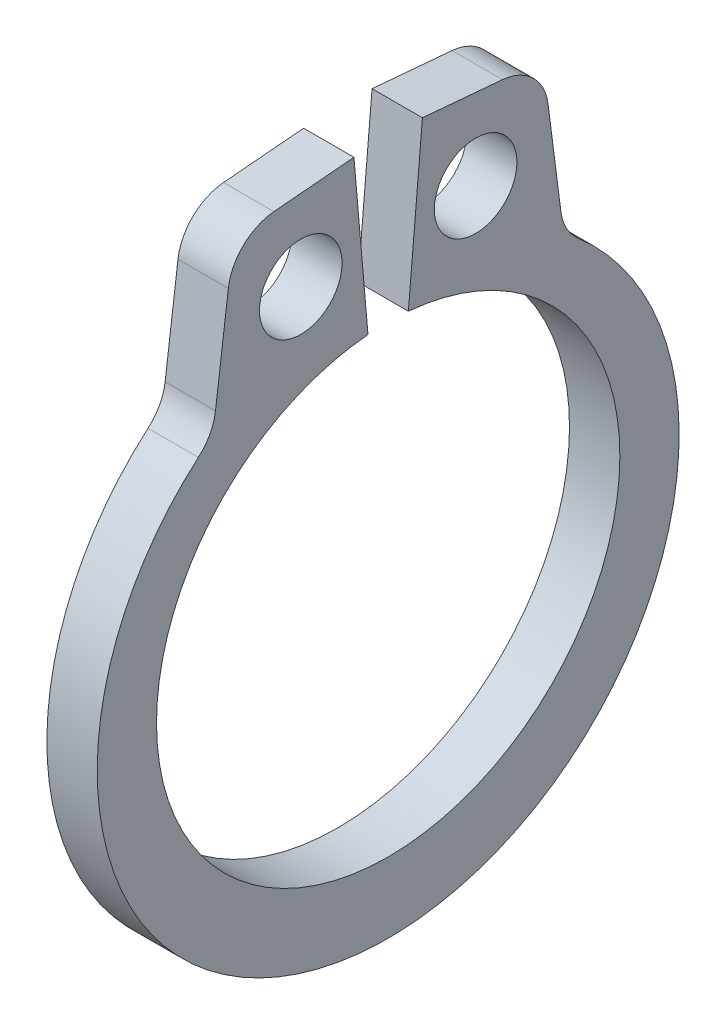
ISO-10303-21;
HEADER;
FILE_DESCRIPTION(('STEP AP214'),'2;1');
FILE_NAME('part.step','',(''),(''),'','','');
FILE_SCHEMA(('AUTOMOTIVE_DESIGN { 1 0 10303 214 1 1 1 1 }'));
ENDSEC;
DATA;
#1=APPLICATION_CONTEXT('core data for automotive mechanical design processes');
#2=APPLICATION_PROTOCOL_DEFINITION('international standard','automotive_design',2000,#1);
#3=PRODUCT_CONTEXT('',#1,'mechanical');
#4=PRODUCT('Part','Part','',(#3));
#5=PRODUCT_RELATED_PRODUCT_CATEGORY('part','',(#4));
#6=PRODUCT_DEFINITION_FORMATION('','',#4);
#7=PRODUCT_DEFINITION_CONTEXT('part definition',#1,'design');
#8=PRODUCT_DEFINITION('design','',#6,#7);
#9=PRODUCT_DEFINITION_SHAPE('','',#8);
#10=(LENGTH_UNIT() NAMED_UNIT(*) SI_UNIT(.MILLI.,.METRE.));
#11=(NAMED_UNIT(*) PLANE_ANGLE_UNIT() SI_UNIT($,.RADIAN.));
#12=(NAMED_UNIT(*) SI_UNIT($,.STERADIAN.) SOLID_ANGLE_UNIT());
#13=UNCERTAINTY_MEASURE_WITH_UNIT(LENGTH_MEASURE(1.E-05),#10,'distance_accuracy_value','');
#14=(GEOMETRIC_REPRESENTATION_CONTEXT(3) GLOBAL_UNCERTAINTY_ASSIGNED_CONTEXT((#13)) GLOBAL_UNIT_ASSIGNED_CONTEXT((#10,
#11,#12)) REPRESENTATION_CONTEXT('',''));
#15=CARTESIAN_POINT('',(0.,0.,0.));
#16=DIRECTION('',(0.,0.,1.));
#17=DIRECTION('',(1.,0.,0.));
#18=AXIS2_PLACEMENT_3D('',#15,#16,#17);
#19=CARTESIAN_POINT('',(0.3175,0.,0.));
#20=DIRECTION('',(1.,0.,0.));
#21=DIRECTION('',(0.,0.,-1.));
#22=AXIS2_PLACEMENT_3D('',#19,#20,#21);
#23=PLANE('',#22);
#24=CARTESIAN_POINT('',(0.3175,3.85560585041349,-1.10223251914344));
#25=DIRECTION('',(-1.,0.,0.));
#26=DIRECTION('',(0.,0.,1.));
#27=AXIS2_PLACEMENT_3D('',#24,#25,#26);
#28=CIRCLE('',#27,0.5207);
#29=CARTESIAN_POINT('',(0.3175,3.85560585041349,-0.581532519143441));
#30=VERTEX_POINT('',#29);
#31=EDGE_CURVE('E107',#30,#30,#28,.T.);
#32=ORIENTED_EDGE('',*,*,#31,.T.);
#33=EDGE_LOOP('',(#32));
#34=FACE_BOUND('',#33,.T.);
#35=CARTESIAN_POINT('',(0.3175,0.,0.));
#36=DIRECTION('',(-1.,0.,0.));
#37=DIRECTION('',(0.,0.,1.));
#38=AXIS2_PLACEMENT_3D('',#35,#36,#37);
#39=CIRCLE('',#38,2.921);
#40=CARTESIAN_POINT('',(0.3175,2.90988471312599,-0.25458192456591));
#41=VERTEX_POINT('',#40);
#42=CARTESIAN_POINT('',(0.3175,2.90988471312599,0.25458192456591));
#43=VERTEX_POINT('',#42);
#44=EDGE_CURVE('E173',#41,#43,#39,.T.);
#45=ORIENTED_EDGE('',*,*,#44,.T.);
#46=DIRECTION('',(0.,-0.996194698091746,-0.0871557427476584));
#47=VECTOR('',#46,1.);
#48=CARTESIAN_POINT('',(0.3175,2.90988471312599,0.25458192456591));
#49=LINE('',#48,#47);
#50=CARTESIAN_POINT('',(0.3175,4.93415233964842,0.431682393829152));
#51=VERTEX_POINT('',#50);
#52=EDGE_CURVE('E123',#43,#51,#49,.F.);
#53=ORIENTED_EDGE('',*,*,#52,.T.);
#54=DIRECTION('',(0.,0.0871557427476587,-0.996194698091746));
#55=VECTOR('',#54,1.);
#56=CARTESIAN_POINT('',(0.3175,4.93415233964842,0.431682393829152));
#57=LINE('',#56,#55);
#58=CARTESIAN_POINT('',(0.3175,4.84586515186069,1.44080956790658));
#59=VERTEX_POINT('',#58);
#60=EDGE_CURVE('E118',#51,#59,#57,.F.);
#61=ORIENTED_EDGE('',*,*,#60,.T.);
#62=CARTESIAN_POINT('',(0.3175,4.21328151857243,1.38546567126182));
#63=DIRECTION('',(-1.,0.,0.));
#64=DIRECTION('',(0.,0.,1.));
#65=AXIS2_PLACEMENT_3D('',#62,#63,#64);
#66=CIRCLE('',#65,0.635);
#67=CARTESIAN_POINT('',(0.3175,4.2945067237745,2.01524933732492));
#68=VERTEX_POINT('',#67);
#69=EDGE_CURVE('E111',#68,#59,#66,.T.);
#70=ORIENTED_EDGE('',*,*,#69,.F.);
#71=DIRECTION('',(0.,0.991785300886776,-0.127913708979639));
#72=VECTOR('',#71,1.);
#73=CARTESIAN_POINT('',(0.3175,4.80132698770098,1.94988311372097));
#74=LINE('',#73,#72);
#75=CARTESIAN_POINT('',(0.3175,3.03853740820642,2.17723570007429));
#76=VERTEX_POINT('',#75);
#77=EDGE_CURVE('E106',#68,#76,#74,.F.);
#78=ORIENTED_EDGE('',*,*,#77,.T.);
#79=CARTESIAN_POINT('',(0.3175,3.11976261340849,2.80701936613739));
#80=DIRECTION('',(-1.,0.,0.));
#81=DIRECTION('',(0.,0.,1.));
#82=AXIS2_PLACEMENT_3D('',#79,#80,#81);
#83=CIRCLE('',#82,0.635);
#84=CARTESIAN_POINT('',(0.3175,2.63846487393826,2.39280023816181));
#85=VERTEX_POINT('',#84);
#86=EDGE_CURVE('E97',#76,#85,#83,.T.);
#87=ORIENTED_EDGE('',*,*,#86,.T.);
#88=CARTESIAN_POINT('',(0.3175,-0.141825237867011,0.));
#89=DIRECTION('',(-1.,0.,0.));
#90=DIRECTION('',(0.,0.,1.));
#91=AXIS2_PLACEMENT_3D('',#88,#89,#90);
#92=CIRCLE('',#91,3.66817476213299);
#93=CARTESIAN_POINT('',(0.3175,2.63846487393826,-2.39280023816181));
#94=VERTEX_POINT('',#93);
#95=EDGE_CURVE('E180',#94,#85,#92,.T.);
#96=ORIENTED_EDGE('',*,*,#95,.F.);
#97=CARTESIAN_POINT('',(0.3175,3.11976261340849,-2.80701936613739));
#98=DIRECTION('',(-1.,0.,0.));
#99=DIRECTION('',(0.,0.,1.));
#100=AXIS2_PLACEMENT_3D('',#97,#98,#99);
#101=CIRCLE('',#100,0.635);
#102=CARTESIAN_POINT('',(0.3175,3.03853740820642,-2.17723570007429));
#103=VERTEX_POINT('',#102);
#104=EDGE_CURVE('E177',#94,#103,#101,.T.);
#105=ORIENTED_EDGE('',*,*,#104,.T.);
#106=DIRECTION('',(0.,-0.991785300886776,-0.127913708979639));
#107=VECTOR('',#106,1.);
#108=CARTESIAN_POINT('',(0.3175,4.80132698770098,-1.94988311372097));
#109=LINE('',#108,#107);
#110=CARTESIAN_POINT('',(0.3175,4.2945067237745,-2.01524933732492));
#111=VERTEX_POINT('',#110);
#112=EDGE_CURVE('E142',#103,#111,#109,.F.);
#113=ORIENTED_EDGE('',*,*,#112,.T.);
#114=CARTESIAN_POINT('',(0.3175,4.21328151857243,-1.38546567126182));
#115=DIRECTION('',(-1.,0.,0.));
#116=DIRECTION('',(0.,0.,1.));
#117=AXIS2_PLACEMENT_3D('',#114,#115,#116);
#118=CIRCLE('',#117,0.635);
#119=CARTESIAN_POINT('',(0.3175,4.84586515186069,-1.44080956790658));
#120=VERTEX_POINT('',#119);
#121=EDGE_CURVE('E144',#120,#111,#118,.T.);
#122=ORIENTED_EDGE('',*,*,#121,.F.);
#123=DIRECTION('',(0.,-0.0871557427476587,-0.996194698091746));
#124=VECTOR('',#123,1.);
#125=CARTESIAN_POINT('',(0.3175,4.93415233964842,-0.431682393829152));
#126=LINE('',#125,#124);
#127=CARTESIAN_POINT('',(0.3175,4.93415233964842,-0.431682393829152));
#128=VERTEX_POINT('',#127);
#129=EDGE_CURVE('E136',#120,#128,#126,.F.);
#130=ORIENTED_EDGE('',*,*,#129,.T.);
#131=DIRECTION('',(0.,0.996194698091746,-0.0871557427476584));
#132=VECTOR('',#131,1.);
#133=CARTESIAN_POINT('',(0.3175,2.90988471312599,-0.25458192456591));
#134=LINE('',#133,#132);
#135=EDGE_CURVE('E129',#128,#41,#134,.F.);
#136=ORIENTED_EDGE('',*,*,#135,.T.);
#137=EDGE_LOOP('',(#45,#53,#61,#70,#78,#87,#96,#105,#113,#122,#130,#136));
#138=FACE_BOUND('',#137,.T.);
#139=CARTESIAN_POINT('',(0.3175,3.85560585041349,1.10223251914344));
#140=DIRECTION('',(-1.,0.,0.));
#141=DIRECTION('',(0.,0.,1.));
#142=AXIS2_PLACEMENT_3D('',#139,#140,#141);
#143=CIRCLE('',#142,0.5207);
#144=CARTESIAN_POINT('',(0.3175,3.85560585041349,1.62293251914344));
#145=VERTEX_POINT('',#144);
#146=EDGE_CURVE('E19',#145,#145,#143,.T.);
#147=ORIENTED_EDGE('',*,*,#146,.T.);
#148=EDGE_LOOP('',(#147));
#149=FACE_BOUND('',#148,.T.);
#150=ADVANCED_FACE('F16',(#34,#138,#149),#23,.T.);
#151=CARTESIAN_POINT('',(0.3175,3.85560585041349,1.10223251914344));
#152=DIRECTION('',(-1.,0.,0.));
#153=DIRECTION('',(0.,0.,1.));
#154=AXIS2_PLACEMENT_3D('',#151,#152,#153);
#155=CYLINDRICAL_SURFACE('',#154,0.5207);
#156=CARTESIAN_POINT('',(-0.3175,3.85560585041349,1.10223251914344));
#157=DIRECTION('',(-1.,0.,0.));
#158=DIRECTION('',(0.,0.,1.));
#159=AXIS2_PLACEMENT_3D('',#156,#157,#158);
#160=CIRCLE('',#159,0.5207);
#161=CARTESIAN_POINT('',(-0.3175,3.85560585041349,1.62293251914344));
#162=VERTEX_POINT('',#161);
#163=EDGE_CURVE('E167',#162,#162,#160,.T.);
#164=ORIENTED_EDGE('',*,*,#163,.T.);
#165=EDGE_LOOP('',(#164));
#166=FACE_BOUND('',#165,.T.);
#167=ORIENTED_EDGE('',*,*,#146,.F.);
#168=EDGE_LOOP('',(#167));
#169=FACE_BOUND('',#168,.T.);
#170=ADVANCED_FACE('F387',(#166,#169),#155,.F.);
#171=CARTESIAN_POINT('',(0.3175,3.11976261340849,2.80701936613739));
#172=DIRECTION('',(-1.,0.,0.));
#173=DIRECTION('',(0.,0.,1.));
#174=AXIS2_PLACEMENT_3D('',#171,#172,#173);
#175=CYLINDRICAL_SURFACE('',#174,0.635);
#176=DIRECTION('',(1.,0.,0.));
#177=VECTOR('',#176,1.);
#178=CARTESIAN_POINT('',(0.3175,3.03853740820642,2.17723570007429));
#179=LINE('',#178,#177);
#180=CARTESIAN_POINT('',(-0.3175,3.03853740820642,2.17723570007429));
#181=VERTEX_POINT('',#180);
#182=EDGE_CURVE('E101',#76,#181,#179,.F.);
#183=ORIENTED_EDGE('',*,*,#182,.T.);
#184=CARTESIAN_POINT('',(-0.3175,3.11976261340849,2.80701936613739));
#185=DIRECTION('',(-1.,0.,0.));
#186=DIRECTION('',(0.,0.,1.));
#187=AXIS2_PLACEMENT_3D('',#184,#185,#186);
#188=CIRCLE('',#187,0.635);
#189=CARTESIAN_POINT('',(-0.3175,2.63846487393826,2.39280023816181));
#190=VERTEX_POINT('',#189);
#191=EDGE_CURVE('E165',#181,#190,#188,.T.);
#192=ORIENTED_EDGE('',*,*,#191,.T.);
#193=DIRECTION('',(-1.,0.,0.));
#194=VECTOR('',#193,1.);
#195=CARTESIAN_POINT('',(0.3175,2.63846487393826,2.39280023816181));
#196=LINE('',#195,#194);
#197=EDGE_CURVE('E102',#85,#190,#196,.T.);
#198=ORIENTED_EDGE('',*,*,#197,.F.);
#199=ORIENTED_EDGE('',*,*,#86,.F.);
#200=EDGE_LOOP('',(#183,#192,#198,#199));
#201=FACE_BOUND('',#200,.T.);
#202=ADVANCED_FACE('F99',(#201),#175,.F.);
#203=CARTESIAN_POINT('',(0.3175,-0.141825237867011,0.));
#204=DIRECTION('',(-1.,0.,0.));
#205=DIRECTION('',(0.,0.,1.));
#206=AXIS2_PLACEMENT_3D('',#203,#204,#205);
#207=CYLINDRICAL_SURFACE('',#206,3.66817476213299);
#208=CARTESIAN_POINT('',(-0.3175,-0.141825237867011,0.));
#209=DIRECTION('',(-1.,0.,0.));
#210=DIRECTION('',(0.,0.,1.));
#211=AXIS2_PLACEMENT_3D('',#208,#209,#210);
#212=CIRCLE('',#211,3.66817476213299);
#213=CARTESIAN_POINT('',(-0.3175,2.63846487393826,-2.39280023816181));
#214=VERTEX_POINT('',#213);
#215=EDGE_CURVE('E163',#190,#214,#212,.F.);
#216=ORIENTED_EDGE('',*,*,#215,.T.);
#217=DIRECTION('',(-1.,0.,0.));
#218=VECTOR('',#217,1.);
#219=CARTESIAN_POINT('',(0.3175,2.63846487393826,-2.39280023816181));
#220=LINE('',#219,#218);
#221=EDGE_CURVE('E179',#214,#94,#220,.F.);
#222=ORIENTED_EDGE('',*,*,#221,.T.);
#223=ORIENTED_EDGE('',*,*,#95,.T.);
#224=ORIENTED_EDGE('',*,*,#197,.T.);
#225=EDGE_LOOP('',(#216,#222,#223,#224));
#226=FACE_BOUND('',#225,.T.);
#227=ADVANCED_FACE('F185',(#226),#207,.T.);
#228=CARTESIAN_POINT('',(0.3175,3.11976261340849,-2.80701936613739));
#229=DIRECTION('',(-1.,0.,0.));
#230=DIRECTION('',(0.,0.,1.));
#231=AXIS2_PLACEMENT_3D('',#228,#229,#230);
#232=CYLINDRICAL_SURFACE('',#231,0.635);
#233=ORIENTED_EDGE('',*,*,#221,.F.);
#234=CARTESIAN_POINT('',(-0.3175,3.11976261340849,-2.80701936613739));
#235=DIRECTION('',(-1.,0.,0.));
#236=DIRECTION('',(0.,0.,1.));
#237=AXIS2_PLACEMENT_3D('',#234,#235,#236);
#238=CIRCLE('',#237,0.635);
#239=CARTESIAN_POINT('',(-0.3175,3.03853740820642,-2.17723570007429));
#240=VERTEX_POINT('',#239);
#241=EDGE_CURVE('E160',#214,#240,#238,.T.);
#242=ORIENTED_EDGE('',*,*,#241,.T.);
#243=DIRECTION('',(1.,0.,0.));
#244=VECTOR('',#243,1.);
#245=CARTESIAN_POINT('',(0.3175,3.03853740820642,-2.17723570007429));
#246=LINE('',#245,#244);
#247=EDGE_CURVE('E145',#240,#103,#246,.T.);
#248=ORIENTED_EDGE('',*,*,#247,.T.);
#249=ORIENTED_EDGE('',*,*,#104,.F.);
#250=EDGE_LOOP('',(#233,#242,#248,#249));
#251=FACE_BOUND('',#250,.T.);
#252=ADVANCED_FACE('F197',(#251),#232,.F.);
#253=CARTESIAN_POINT('',(0.3175,4.80132698770098,-1.94988311372097));
#254=DIRECTION('',(0.,-0.127913708979639,0.991785300886776));
#255=DIRECTION('',(0.,-0.991785300886776,-0.127913708979639));
#256=AXIS2_PLACEMENT_3D('',#253,#254,#255);
#257=PLANE('',#256);
#258=ORIENTED_EDGE('',*,*,#247,.F.);
#259=DIRECTION('',(0.,0.991785300886776,0.127913708979639));
#260=VECTOR('',#259,1.);
#261=CARTESIAN_POINT('',(-0.3175,3.03853740820642,-2.17723570007429));
#262=LINE('',#261,#260);
#263=CARTESIAN_POINT('',(-0.3175,4.2945067237745,-2.01524933732492));
#264=VERTEX_POINT('',#263);
#265=EDGE_CURVE('E159',#240,#264,#262,.T.);
#266=ORIENTED_EDGE('',*,*,#265,.T.);
#267=DIRECTION('',(-1.,0.,0.));
#268=VECTOR('',#267,1.);
#269=CARTESIAN_POINT('',(0.3175,4.2945067237745,-2.01524933732492));
#270=LINE('',#269,#268);
#271=EDGE_CURVE('E176',#111,#264,#270,.T.);
#272=ORIENTED_EDGE('',*,*,#271,.F.);
#273=ORIENTED_EDGE('',*,*,#112,.F.);
#274=EDGE_LOOP('',(#258,#266,#272,#273));
#275=FACE_BOUND('',#274,.T.);
#276=ADVANCED_FACE('F202',(#275),#257,.F.);
#277=CARTESIAN_POINT('',(0.3175,4.21328151857243,-1.38546567126182));
#278=DIRECTION('',(-1.,0.,0.));
#279=DIRECTION('',(0.,0.,1.));
#280=AXIS2_PLACEMENT_3D('',#277,#278,#279);
#281=CYLINDRICAL_SURFACE('',#280,0.635);
#282=CARTESIAN_POINT('',(-0.3175,4.21328151857243,-1.38546567126182));
#283=DIRECTION('',(-1.,0.,0.));
#284=DIRECTION('',(0.,0.,1.));
#285=AXIS2_PLACEMENT_3D('',#282,#283,#284);
#286=CIRCLE('',#285,0.635);
#287=CARTESIAN_POINT('',(-0.3175,4.84586515186069,-1.44080956790658));
#288=VERTEX_POINT('',#287);
#289=EDGE_CURVE('E155',#264,#288,#286,.F.);
#290=ORIENTED_EDGE('',*,*,#289,.T.);
#291=DIRECTION('',(1.,0.,0.));
#292=VECTOR('',#291,1.);
#293=CARTESIAN_POINT('',(0.3175,4.84586515186069,-1.44080956790658));
#294=LINE('',#293,#292);
#295=EDGE_CURVE('E139',#288,#120,#294,.T.);
#296=ORIENTED_EDGE('',*,*,#295,.T.);
#297=ORIENTED_EDGE('',*,*,#121,.T.);
#298=ORIENTED_EDGE('',*,*,#271,.T.);
#299=EDGE_LOOP('',(#290,#296,#297,#298));
#300=FACE_BOUND('',#299,.T.);
#301=ADVANCED_FACE('F265',(#300),#281,.T.);
#302=CARTESIAN_POINT('',(0.3175,4.93415233964842,-0.431682393829152));
#303=DIRECTION('',(0.,-0.996194698091746,0.0871557427476587));
#304=DIRECTION('',(0.,-0.0871557427476587,-0.996194698091746));
#305=AXIS2_PLACEMENT_3D('',#302,#303,#304);
#306=PLANE('',#305);
#307=ORIENTED_EDGE('',*,*,#295,.F.);
#308=DIRECTION('',(0.,0.0871557427476588,0.996194698091746));
#309=VECTOR('',#308,1.);
#310=CARTESIAN_POINT('',(-0.3175,4.84586515186069,-1.44080956790658));
#311=LINE('',#310,#309);
#312=CARTESIAN_POINT('',(-0.3175,4.93415233964842,-0.431682393829152));
#313=VERTEX_POINT('',#312);
#314=EDGE_CURVE('E158',#288,#313,#311,.T.);
#315=ORIENTED_EDGE('',*,*,#314,.T.);
#316=DIRECTION('',(1.,0.,0.));
#317=VECTOR('',#316,1.);
#318=CARTESIAN_POINT('',(0.3175,4.93415233964842,-0.431682393829152));
#319=LINE('',#318,#317);
#320=EDGE_CURVE('E133',#313,#128,#319,.T.);
#321=ORIENTED_EDGE('',*,*,#320,.T.);
#322=ORIENTED_EDGE('',*,*,#129,.F.);
#323=EDGE_LOOP('',(#307,#315,#321,#322));
#324=FACE_BOUND('',#323,.T.);
#325=ADVANCED_FACE('F263',(#324),#306,.F.);
#326=CARTESIAN_POINT('',(0.3175,2.90988471312599,-0.25458192456591));
#327=DIRECTION('',(0.,-0.0871557427476584,-0.996194698091746));
#328=DIRECTION('',(0.,0.996194698091746,-0.0871557427476584));
#329=AXIS2_PLACEMENT_3D('',#326,#327,#328);
#330=PLANE('',#329);
#331=DIRECTION('',(-1.,0.,0.));
#332=VECTOR('',#331,1.);
#333=CARTESIAN_POINT('',(0.3175,2.90988471312599,-0.25458192456591));
#334=LINE('',#333,#332);
#335=CARTESIAN_POINT('',(-0.3175,2.90988471312599,-0.25458192456591));
#336=VERTEX_POINT('',#335);
#337=EDGE_CURVE('E132',#336,#41,#334,.F.);
#338=ORIENTED_EDGE('',*,*,#337,.T.);
#339=ORIENTED_EDGE('',*,*,#135,.F.);
#340=ORIENTED_EDGE('',*,*,#320,.F.);
#341=DIRECTION('',(0.,-0.996194698091746,0.0871557427476584));
#342=VECTOR('',#341,1.);
#343=CARTESIAN_POINT('',(-0.3175,4.93415233964842,-0.431682393829152));
#344=LINE('',#343,#342);
#345=EDGE_CURVE('E154',#313,#336,#344,.T.);
#346=ORIENTED_EDGE('',*,*,#345,.T.);
#347=EDGE_LOOP('',(#338,#339,#340,#346));
#348=FACE_BOUND('',#347,.T.);
#349=ADVANCED_FACE('F258',(#348),#330,.F.);
#350=CARTESIAN_POINT('',(0.3175,0.,0.));
#351=DIRECTION('',(-1.,0.,0.));
#352=DIRECTION('',(0.,0.,1.));
#353=AXIS2_PLACEMENT_3D('',#350,#351,#352);
#354=CYLINDRICAL_SURFACE('',#353,2.921);
#355=ORIENTED_EDGE('',*,*,#44,.F.);
#356=ORIENTED_EDGE('',*,*,#337,.F.);
#357=CARTESIAN_POINT('',(-0.3175,0.,0.));
#358=DIRECTION('',(-1.,0.,0.));
#359=DIRECTION('',(0.,0.,1.));
#360=AXIS2_PLACEMENT_3D('',#357,#358,#359);
#361=CIRCLE('',#360,2.921);
#362=CARTESIAN_POINT('',(-0.3175,2.90988471312599,0.25458192456591));
#363=VERTEX_POINT('',#362);
#364=EDGE_CURVE('E151',#336,#363,#361,.T.);
#365=ORIENTED_EDGE('',*,*,#364,.T.);
#366=DIRECTION('',(1.,0.,0.));
#367=VECTOR('',#366,1.);
#368=CARTESIAN_POINT('',(0.3175,2.90988471312599,0.25458192456591));
#369=LINE('',#368,#367);
#370=EDGE_CURVE('E126',#363,#43,#369,.T.);
#371=ORIENTED_EDGE('',*,*,#370,.T.);
#372=EDGE_LOOP('',(#355,#356,#365,#371));
#373=FACE_BOUND('',#372,.T.);
#374=ADVANCED_FACE('F253',(#373),#354,.F.);
#375=CARTESIAN_POINT('',(0.3175,2.90988471312599,0.25458192456591));
#376=DIRECTION('',(0.,-0.0871557427476584,0.996194698091746));
#377=DIRECTION('',(0.,-0.996194698091746,-0.0871557427476584));
#378=AXIS2_PLACEMENT_3D('',#375,#376,#377);
#379=PLANE('',#378);
#380=DIRECTION('',(1.,0.,0.));
#381=VECTOR('',#380,1.);
#382=CARTESIAN_POINT('',(0.3175,4.93415233964842,0.431682393829152));
#383=LINE('',#382,#381);
#384=CARTESIAN_POINT('',(-0.3175,4.93415233964842,0.431682393829152));
#385=VERTEX_POINT('',#384);
#386=EDGE_CURVE('E120',#385,#51,#383,.T.);
#387=ORIENTED_EDGE('',*,*,#386,.T.);
#388=ORIENTED_EDGE('',*,*,#52,.F.);
#389=ORIENTED_EDGE('',*,*,#370,.F.);
#390=DIRECTION('',(0.,0.996194698091746,0.0871557427476584));
#391=VECTOR('',#390,1.);
#392=CARTESIAN_POINT('',(-0.3175,2.90988471312599,0.25458192456591));
#393=LINE('',#392,#391);
#394=EDGE_CURVE('E153',#363,#385,#393,.T.);
#395=ORIENTED_EDGE('',*,*,#394,.T.);
#396=EDGE_LOOP('',(#387,#388,#389,#395));
#397=FACE_BOUND('',#396,.T.);
#398=ADVANCED_FACE('F250',(#397),#379,.F.);
#399=CARTESIAN_POINT('',(0.3175,4.93415233964842,0.431682393829152));
#400=DIRECTION('',(0.,-0.996194698091746,-0.0871557427476587));
#401=DIRECTION('',(0.,0.0871557427476587,-0.996194698091746));
#402=AXIS2_PLACEMENT_3D('',#399,#400,#401);
#403=PLANE('',#402);
#404=DIRECTION('',(-1.,0.,0.));
#405=VECTOR('',#404,1.);
#406=CARTESIAN_POINT('',(0.3175,4.84586515186069,1.44080956790658));
#407=LINE('',#406,#405);
#408=CARTESIAN_POINT('',(-0.3175,4.84586515186069,1.44080956790658));
#409=VERTEX_POINT('',#408);
#410=EDGE_CURVE('E113',#59,#409,#407,.T.);
#411=ORIENTED_EDGE('',*,*,#410,.F.);
#412=ORIENTED_EDGE('',*,*,#60,.F.);
#413=ORIENTED_EDGE('',*,*,#386,.F.);
#414=DIRECTION('',(0.,-0.0871557427476588,0.996194698091746));
#415=VECTOR('',#414,1.);
#416=CARTESIAN_POINT('',(-0.3175,4.93415233964842,0.431682393829152));
#417=LINE('',#416,#415);
#418=EDGE_CURVE('E150',#385,#409,#417,.T.);
#419=ORIENTED_EDGE('',*,*,#418,.T.);
#420=EDGE_LOOP('',(#411,#412,#413,#419));
#421=FACE_BOUND('',#420,.T.);
#422=ADVANCED_FACE('F243',(#421),#403,.F.);
#423=CARTESIAN_POINT('',(0.3175,4.21328151857243,1.38546567126182));
#424=DIRECTION('',(-1.,0.,0.));
#425=DIRECTION('',(0.,0.,1.));
#426=AXIS2_PLACEMENT_3D('',#423,#424,#425);
#427=CYLINDRICAL_SURFACE('',#426,0.635);
#428=CARTESIAN_POINT('',(-0.3175,4.21328151857243,1.38546567126182));
#429=DIRECTION('',(-1.,0.,0.));
#430=DIRECTION('',(0.,0.,1.));
#431=AXIS2_PLACEMENT_3D('',#428,#429,#430);
#432=CIRCLE('',#431,0.635);
#433=CARTESIAN_POINT('',(-0.3175,4.2945067237745,2.01524933732492));
#434=VERTEX_POINT('',#433);
#435=EDGE_CURVE('E147',#409,#434,#432,.F.);
#436=ORIENTED_EDGE('',*,*,#435,.T.);
#437=DIRECTION('',(1.,0.,0.));
#438=VECTOR('',#437,1.);
#439=CARTESIAN_POINT('',(0.3175,4.2945067237745,2.01524933732492));
#440=LINE('',#439,#438);
#441=EDGE_CURVE('E34',#434,#68,#440,.T.);
#442=ORIENTED_EDGE('',*,*,#441,.T.);
#443=ORIENTED_EDGE('',*,*,#69,.T.);
#444=ORIENTED_EDGE('',*,*,#410,.T.);
#445=EDGE_LOOP('',(#436,#442,#443,#444));
#446=FACE_BOUND('',#445,.T.);
#447=ADVANCED_FACE('F288',(#446),#427,.T.);
#448=CARTESIAN_POINT('',(0.3175,4.80132698770098,1.94988311372097));
#449=DIRECTION('',(0.,-0.127913708979639,-0.991785300886776));
#450=DIRECTION('',(0.,0.991785300886776,-0.127913708979639));
#451=AXIS2_PLACEMENT_3D('',#448,#449,#450);
#452=PLANE('',#451);
#453=ORIENTED_EDGE('',*,*,#182,.F.);
#454=ORIENTED_EDGE('',*,*,#77,.F.);
#455=ORIENTED_EDGE('',*,*,#441,.F.);
#456=DIRECTION('',(0.,-0.991785300886776,0.127913708979639));
#457=VECTOR('',#456,1.);
#458=CARTESIAN_POINT('',(-0.3175,4.2945067237745,2.01524933732492));
#459=LINE('',#458,#457);
#460=EDGE_CURVE('E25',#434,#181,#459,.T.);
#461=ORIENTED_EDGE('',*,*,#460,.T.);
#462=EDGE_LOOP('',(#453,#454,#455,#461));
#463=FACE_BOUND('',#462,.T.);
#464=ADVANCED_FACE('F105',(#463),#452,.F.);
#465=CARTESIAN_POINT('',(0.3175,3.85560585041349,-1.10223251914344));
#466=DIRECTION('',(-1.,0.,0.));
#467=DIRECTION('',(0.,0.,1.));
#468=AXIS2_PLACEMENT_3D('',#465,#466,#467);
#469=CYLINDRICAL_SURFACE('',#468,0.5207);
#470=CARTESIAN_POINT('',(-0.3175,3.85560585041349,-1.10223251914344));
#471=DIRECTION('',(-1.,0.,0.));
#472=DIRECTION('',(0.,0.,1.));
#473=AXIS2_PLACEMENT_3D('',#470,#471,#472);
#474=CIRCLE('',#473,0.5207);
#475=CARTESIAN_POINT('',(-0.3175,3.85560585041349,-0.581532519143441));
#476=VERTEX_POINT('',#475);
#477=EDGE_CURVE('E11',#476,#476,#474,.T.);
#478=ORIENTED_EDGE('',*,*,#477,.T.);
#479=EDGE_LOOP('',(#478));
#480=FACE_BOUND('',#479,.T.);
#481=ORIENTED_EDGE('',*,*,#31,.F.);
#482=EDGE_LOOP('',(#481));
#483=FACE_BOUND('',#482,.T.);
#484=ADVANCED_FACE('F276',(#480,#483),#469,.F.);
#485=CARTESIAN_POINT('',(-0.3175,0.,0.));
#486=DIRECTION('',(1.,0.,0.));
#487=DIRECTION('',(0.,0.,-1.));
#488=AXIS2_PLACEMENT_3D('',#485,#486,#487);
#489=PLANE('',#488);
#490=ORIENTED_EDGE('',*,*,#477,.F.);
#491=EDGE_LOOP('',(#490));
#492=FACE_BOUND('',#491,.T.);
#493=ORIENTED_EDGE('',*,*,#435,.F.);
#494=ORIENTED_EDGE('',*,*,#418,.F.);
#495=ORIENTED_EDGE('',*,*,#394,.F.);
#496=ORIENTED_EDGE('',*,*,#364,.F.);
#497=ORIENTED_EDGE('',*,*,#345,.F.);
#498=ORIENTED_EDGE('',*,*,#314,.F.);
#499=ORIENTED_EDGE('',*,*,#289,.F.);
#500=ORIENTED_EDGE('',*,*,#265,.F.);
#501=ORIENTED_EDGE('',*,*,#241,.F.);
#502=ORIENTED_EDGE('',*,*,#215,.F.);
#503=ORIENTED_EDGE('',*,*,#191,.F.);
#504=ORIENTED_EDGE('',*,*,#460,.F.);
#505=EDGE_LOOP('',(#493,#494,#495,#496,#497,#498,#499,#500,#501,#502,#503,#504));
#506=FACE_BOUND('',#505,.T.);
#507=ORIENTED_EDGE('',*,*,#163,.F.);
#508=EDGE_LOOP('',(#507));
#509=FACE_BOUND('',#508,.T.);
#510=ADVANCED_FACE('F190',(#492,#506,#509),#489,.F.);
#511=CLOSED_SHELL('',(#150,#170,#202,#227,#252,#276,#301,#325,#349,#374,#398,#422,#447,#464,
#484,#510));
#512=MANIFOLD_SOLID_BREP('B1',#511);
#513=ADVANCED_BREP_SHAPE_REPRESENTATION('',(#18,#512),#14);
#514=SHAPE_DEFINITION_REPRESENTATION(#9,#513);
ENDSEC;
END-ISO-10303-21;
